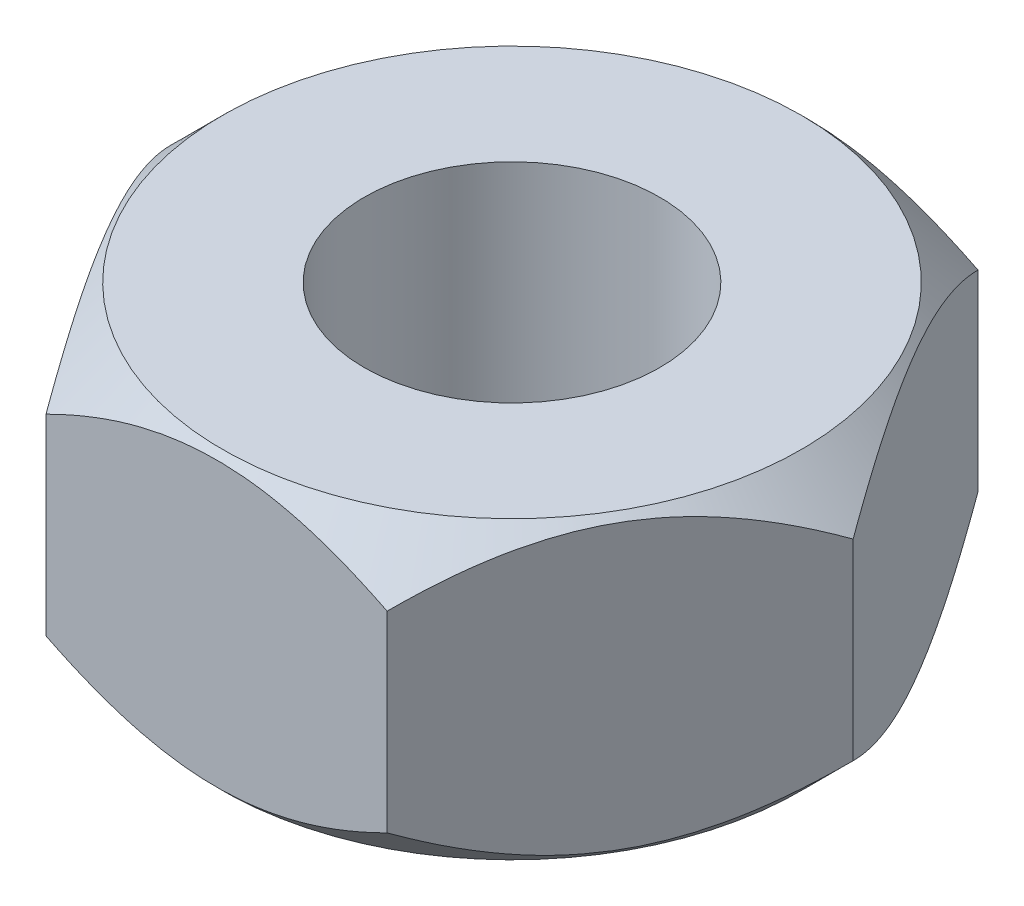
ISO-10303-21;
HEADER;
FILE_DESCRIPTION(('STEP AP214'),'2;1');
FILE_NAME('part.step','',(''),(''),'','','');
FILE_SCHEMA(('AUTOMOTIVE_DESIGN { 1 0 10303 214 1 1 1 1 }'));
ENDSEC;
DATA;
#1=APPLICATION_CONTEXT('core data for automotive mechanical design processes');
#2=APPLICATION_PROTOCOL_DEFINITION('international standard','automotive_design',2000,#1);
#3=PRODUCT_CONTEXT('',#1,'mechanical');
#4=PRODUCT('Part','Part','',(#3));
#5=PRODUCT_RELATED_PRODUCT_CATEGORY('part','',(#4));
#6=PRODUCT_DEFINITION_FORMATION('','',#4);
#7=PRODUCT_DEFINITION_CONTEXT('part definition',#1,'design');
#8=PRODUCT_DEFINITION('design','',#6,#7);
#9=PRODUCT_DEFINITION_SHAPE('','',#8);
#10=(LENGTH_UNIT() NAMED_UNIT(*) SI_UNIT(.MILLI.,.METRE.));
#11=(NAMED_UNIT(*) PLANE_ANGLE_UNIT() SI_UNIT($,.RADIAN.));
#12=(NAMED_UNIT(*) SI_UNIT($,.STERADIAN.) SOLID_ANGLE_UNIT());
#13=UNCERTAINTY_MEASURE_WITH_UNIT(LENGTH_MEASURE(1.E-05),#10,'distance_accuracy_value','');
#14=(GEOMETRIC_REPRESENTATION_CONTEXT(3) GLOBAL_UNCERTAINTY_ASSIGNED_CONTEXT((#13)) GLOBAL_UNIT_ASSIGNED_CONTEXT((#10,
#11,#12)) REPRESENTATION_CONTEXT('',''));
#15=CARTESIAN_POINT('',(0.,0.,0.));
#16=DIRECTION('',(0.,0.,1.));
#17=DIRECTION('',(1.,0.,0.));
#18=AXIS2_PLACEMENT_3D('',#15,#16,#17);
#19=CARTESIAN_POINT('',(4.61880215351701,2.,0.));
#20=DIRECTION('',(-0.866025403784439,0.,0.5));
#21=DIRECTION('',(0.5,0.,0.866025403784439));
#22=AXIS2_PLACEMENT_3D('',#19,#20,#21);
#23=PLANE('',#22);
#24=CARTESIAN_POINT('',(2.30928560670466,-1.29988452561614,-4.0002));
#25=CARTESIAN_POINT('',(2.34899632674695,-1.33959114404244,-3.93141901528162));
#26=CARTESIAN_POINT('',(2.3890109267086,-1.37807958288684,-3.8621116951035));
#27=CARTESIAN_POINT('',(2.46971048312824,-1.45224877626449,-3.72233596323641));
#28=CARTESIAN_POINT('',(2.51039579126537,-1.48792799726835,-3.6518669424213));
#29=CARTESIAN_POINT('',(2.63392971018403,-1.590499132349,-3.4378999183961));
#30=CARTESIAN_POINT('',(2.71782823500144,-1.65248688898743,-3.29258341073226));
#31=CARTESIAN_POINT('',(2.88698352725106,-1.75864413099059,-2.99959785018675));
#32=CARTESIAN_POINT('',(2.97219756726618,-1.80308094454656,-2.85200280336236));
#33=CARTESIAN_POINT('',(3.14450730387843,-1.87155101787055,-2.55355358491114));
#34=CARTESIAN_POINT('',(3.23159772331381,-1.89563536213869,-2.40270855359657));
#35=CARTESIAN_POINT('',(3.38169462438279,-1.91736511913947,-2.14273309488645));
#36=CARTESIAN_POINT('',(3.44450772236845,-1.92058108535914,-2.03393761779448));
#37=CARTESIAN_POINT('',(3.57003196860172,-1.915159941775,-1.81652324573669));
#38=CARTESIAN_POINT('',(3.63274307339632,-1.90651867682817,-1.70790442603366));
#39=CARTESIAN_POINT('',(3.7575710821747,-1.87787596150357,-1.49169597262186));
#40=CARTESIAN_POINT('',(3.81968724243514,-1.85786180544874,-1.38410762707968));
#41=CARTESIAN_POINT('',(3.94285275199686,-1.80756584263535,-1.17077870677867));
#42=CARTESIAN_POINT('',(4.00390218271576,-1.77728482312164,-1.06503799100038));
#43=CARTESIAN_POINT('',(4.11227961083266,-1.71498474730578,-0.877322779108259));
#44=CARTESIAN_POINT('',(4.15984755582568,-1.6846037201399,-0.794932681568707));
#45=CARTESIAN_POINT('',(4.25412951504788,-1.61894553543966,-0.631631537958719));
#46=CARTESIAN_POINT('',(4.30084350325071,-1.58366822896022,-0.55072053696725));
#47=CARTESIAN_POINT('',(4.39327037218423,-1.50900831297908,-0.390632503989876));
#48=CARTESIAN_POINT('',(4.43898588170052,-1.4696386129964,-0.311450918813769));
#49=CARTESIAN_POINT('',(4.52957030284816,-1.3873108918567,-0.154554099011848));
#50=CARTESIAN_POINT('',(4.57443971345263,-1.34435507219804,-0.0768380001392365));
#51=CARTESIAN_POINT('',(4.61891762357084,-1.29988452561614,0.000200000000000016));
#52=B_SPLINE_CURVE_WITH_KNOTS('',3,(#24,#25,#26,#27,#28,#29,#30,#31,#32,#33,#34,#35,#36,#37,#38,
#39,#40,#41,#42,#43,#44,#45,#46,#47,#48,#49,#50,#51),.UNSPECIFIED.,.F.,.F.,(4,2,2,2,2,2,2,2,2,2,
2,2,2,4),(0.,0.266361961703662,0.532868334400109,1.06875865685462,1.5961388459405,
2.12219135055579,2.49866160599656,2.87526382203492,3.25228760372074,3.62928248242855,
3.92874944437159,4.22822551811344,4.52678401907573,4.82516056577922),.UNSPECIFIED.);
#53=CARTESIAN_POINT('',(2.3094010767585,-1.3,-4.));
#54=VERTEX_POINT('',#53);
#55=CARTESIAN_POINT('',(4.61880215351701,-1.29999999999999,0.));
#56=VERTEX_POINT('',#55);
#57=EDGE_CURVE('E57',#54,#56,#52,.T.);
#58=ORIENTED_EDGE('',*,*,#57,.F.);
#59=DIRECTION('',(0.,-1.,0.));
#60=VECTOR('',#59,1.);
#61=CARTESIAN_POINT('',(2.3094010767585,2.,-4.));
#62=LINE('',#61,#60);
#63=CARTESIAN_POINT('',(2.3094010767585,1.3,-4.));
#64=VERTEX_POINT('',#63);
#65=EDGE_CURVE('E50',#64,#54,#62,.T.);
#66=ORIENTED_EDGE('',*,*,#65,.F.);
#67=CARTESIAN_POINT('',(4.61891762357084,1.29988452561614,0.000199999999999897));
#68=CARTESIAN_POINT('',(4.57920690352856,1.33959114404244,-0.0685809847183834));
#69=CARTESIAN_POINT('',(4.53919230356691,1.37807958288685,-0.137888304896501));
#70=CARTESIAN_POINT('',(4.45849274714727,1.45224877626449,-0.277664036763593));
#71=CARTESIAN_POINT('',(4.41780743901013,1.48792799726835,-0.348133057578704));
#72=CARTESIAN_POINT('',(4.29427352009148,1.590499132349,-0.5621000816039));
#73=CARTESIAN_POINT('',(4.21037499527407,1.65248688898744,-0.707416589267742));
#74=CARTESIAN_POINT('',(4.04121970302445,1.75864413099059,-1.00040214981325));
#75=CARTESIAN_POINT('',(3.95600566300933,1.80308094454656,-1.14799719663764));
#76=CARTESIAN_POINT('',(3.78369592639708,1.87155101787055,-1.44644641508886));
#77=CARTESIAN_POINT('',(3.6966055069617,1.89563536213869,-1.59729144640343));
#78=CARTESIAN_POINT('',(3.54650860589271,1.91736511913947,-1.85726690511355));
#79=CARTESIAN_POINT('',(3.48369550790705,1.92058108535914,-1.96606238220552));
#80=CARTESIAN_POINT('',(3.35817126167379,1.915159941775,-2.18347675426332));
#81=CARTESIAN_POINT('',(3.29546015687919,1.90651867682817,-2.29209557396634));
#82=CARTESIAN_POINT('',(3.17063214810081,1.87787596150357,-2.50830402737814));
#83=CARTESIAN_POINT('',(3.10851598784037,1.85786180544874,-2.61589237292032));
#84=CARTESIAN_POINT('',(2.98535047827865,1.80756584263535,-2.82922129322133));
#85=CARTESIAN_POINT('',(2.92430104755975,1.77728482312164,-2.93496200899963));
#86=CARTESIAN_POINT('',(2.81592361944285,1.71498474730578,-3.12267722089174));
#87=CARTESIAN_POINT('',(2.76835567444983,1.6846037201399,-3.2050673184313));
#88=CARTESIAN_POINT('',(2.67407371522763,1.61894553543966,-3.36836846204128));
#89=CARTESIAN_POINT('',(2.6273597270248,1.58366822896022,-3.44927946303275));
#90=CARTESIAN_POINT('',(2.53493285809127,1.50900831297908,-3.60936749601013));
#91=CARTESIAN_POINT('',(2.48921734857499,1.4696386129964,-3.68854908118623));
#92=CARTESIAN_POINT('',(2.39863292742735,1.3873108918567,-3.84544590098815));
#93=CARTESIAN_POINT('',(2.35376351682288,1.34435507219804,-3.92316199986077));
#94=CARTESIAN_POINT('',(2.30928560670466,1.29988452561614,-4.0002));
#95=B_SPLINE_CURVE_WITH_KNOTS('',3,(#67,#68,#69,#70,#71,#72,#73,#74,#75,#76,#77,#78,#79,#80,#81,
#82,#83,#84,#85,#86,#87,#88,#89,#90,#91,#92,#93,#94),.UNSPECIFIED.,.F.,.F.,(4,2,2,2,2,2,2,2,2,2,
2,2,2,4),(0.,0.266361961703663,0.53286833440011,1.06875865685462,1.5961388459405,
2.12219135055579,2.49866160599657,2.87526382203493,3.25228760372075,3.62928248242855,
3.92874944437159,4.22822551811344,4.52678401907573,4.82516056577922),.UNSPECIFIED.);
#96=CARTESIAN_POINT('',(4.618802153517,1.3,0.));
#97=VERTEX_POINT('',#96);
#98=EDGE_CURVE('E129',#97,#64,#95,.T.);
#99=ORIENTED_EDGE('',*,*,#98,.F.);
#100=DIRECTION('',(0.,-1.,0.));
#101=VECTOR('',#100,1.);
#102=CARTESIAN_POINT('',(4.61880215351701,2.,0.));
#103=LINE('',#102,#101);
#104=EDGE_CURVE('E106',#97,#56,#103,.T.);
#105=ORIENTED_EDGE('',*,*,#104,.T.);
#106=EDGE_LOOP('',(#58,#66,#99,#105));
#107=FACE_BOUND('',#106,.T.);
#108=ADVANCED_FACE('F37',(#107),#23,.F.);
#109=CARTESIAN_POINT('',(2.3094010767585,2.,-4.));
#110=DIRECTION('',(0.,0.,1.));
#111=DIRECTION('',(1.,0.,0.));
#112=AXIS2_PLACEMENT_3D('',#109,#110,#111);
#113=PLANE('',#112);
#114=CARTESIAN_POINT('',(-4.78681449206203,0.319273910576415,-4.));
#115=CARTESIAN_POINT('',(-4.67104008349797,0.230453910789263,-4.));
#116=CARTESIAN_POINT('',(-4.55463815773735,0.14243893989603,-4.));
#117=CARTESIAN_POINT('',(-4.32032412189881,-0.0316142531014706,-4.));
#118=CARTESIAN_POINT('',(-4.20241165794464,-0.117651998302652,-4.));
#119=CARTESIAN_POINT('',(-3.96395938475296,-0.287996404184741,-4.));
#120=CARTESIAN_POINT('',(-3.84340631855997,-0.372284568461999,-4.));
#121=CARTESIAN_POINT('',(-3.60028750313952,-0.537896542327518,-4.));
#122=CARTESIAN_POINT('',(-3.47772189384507,-0.619220556759046,-4.));
#123=CARTESIAN_POINT('',(-3.22251521477572,-0.783196089847759,-4.));
#124=CARTESIAN_POINT('',(-3.08972290431469,-0.865613405269982,-4.));
#125=CARTESIAN_POINT('',(-2.82102210371896,-1.02528760127859,-4.));
#126=CARTESIAN_POINT('',(-2.68511309884137,-1.1025436210766,-4.));
#127=CARTESIAN_POINT('',(-2.41014924678837,-1.25024659927306,-4.));
#128=CARTESIAN_POINT('',(-2.27110522605675,-1.3207135545258,-4.));
#129=CARTESIAN_POINT('',(-1.98910688433591,-1.45325973528072,-4.));
#130=CARTESIAN_POINT('',(-1.84615443515192,-1.51534289414065,-4.));
#131=CARTESIAN_POINT('',(-1.56997288174636,-1.6234247765781,-4.));
#132=CARTESIAN_POINT('',(-1.4371280870701,-1.67039551822276,-4.));
#133=CARTESIAN_POINT('',(-1.16808194542722,-1.75370064413461,-4.));
#134=CARTESIAN_POINT('',(-1.03188038285206,-1.79003434323343,-4.));
#135=CARTESIAN_POINT('',(-0.759289650227042,-1.84950416698731,-4.));
#136=CARTESIAN_POINT('',(-0.622953199238508,-1.87287789770349,-4.));
#137=CARTESIAN_POINT('',(-0.348622081388875,-1.90594495582535,-4.));
#138=CARTESIAN_POINT('',(-0.210627754699727,-1.91564104292016,-4.));
#139=CARTESIAN_POINT('',(0.0597506418957742,-1.92054276275038,-4.));
#140=CARTESIAN_POINT('',(0.192123993251868,-1.91634650776296,-4.));
#141=CARTESIAN_POINT('',(0.455822974914871,-1.89506098686225,-4.));
#142=CARTESIAN_POINT('',(0.587148507853832,-1.87797053654468,-4.));
#143=CARTESIAN_POINT('',(0.850025997668753,-1.83156729638161,-4.));
#144=CARTESIAN_POINT('',(0.981539434199071,-1.80203992185321,-4.));
#145=CARTESIAN_POINT('',(1.24167529836036,-1.73239127253676,-4.));
#146=CARTESIAN_POINT('',(1.37029790184251,-1.69227064404595,-4.));
#147=CARTESIAN_POINT('',(1.63238540595055,-1.600390725109,-4.));
#148=CARTESIAN_POINT('',(1.76564732090925,-1.54805886400987,-4.));
#149=CARTESIAN_POINT('',(2.02873916807871,-1.43531657662984,-4.));
#150=CARTESIAN_POINT('',(2.15856751365365,-1.37490249109738,-4.));
#151=CARTESIAN_POINT('',(2.41540815322982,-1.24742898908148,-4.));
#152=CARTESIAN_POINT('',(2.5424101774856,-1.18034904823898,-4.));
#153=CARTESIAN_POINT('',(2.79350244062854,-1.04102088837257,-4.));
#154=CARTESIAN_POINT('',(2.91759312590425,-0.968773468634677,-4.));
#155=CARTESIAN_POINT('',(3.15717410404656,-0.823793598539983,-4.));
#156=CARTESIAN_POINT('',(3.27278634280148,-0.751261600668097,-4.));
#157=CARTESIAN_POINT('',(3.50202467751727,-0.603114941988064,-4.));
#158=CARTESIAN_POINT('',(3.61565062342367,-0.527500049708325,-4.));
#159=CARTESIAN_POINT('',(3.84026160292468,-0.374354310900573,-4.));
#160=CARTESIAN_POINT('',(3.95126052593079,-0.296843762053549,-4.));
#161=CARTESIAN_POINT('',(4.17173632922504,-0.139748402893968,-4.));
#162=CARTESIAN_POINT('',(4.2812136205638,-0.0601641701448002,-4.));
#163=CARTESIAN_POINT('',(4.39005275405241,0.0202687488517557,-4.));
#164=B_SPLINE_CURVE_WITH_KNOTS('',3,(#114,#115,#116,#117,#118,#119,#120,#121,#122,#123,#124,
#125,#126,#127,#128,#129,#130,#131,#132,#133,#134,#135,#136,#137,#138,#139,#140,#141,#142,#143,
#144,#145,#146,#147,#148,#149,#150,#151,#152,#153,#154,#155,#156,#157,#158,#159,#160,#161,#162,
#163),.UNSPECIFIED.,.F.,.F.,(4,2,2,2,2,2,2,2,2,2,2,2,2,2,2,2,2,2,2,2,2,2,2,2,4),(0.,
0.437768738074165,0.875641979842729,1.31689627841479,1.75812002522053,2.22689529732196,
2.69574855645707,3.16317566763693,3.63038271223574,4.05272994992484,4.4751043864646,
4.88945483060887,5.30372166078581,5.70038877327249,6.09709232629864,6.50094064047318,
6.90476432144563,7.33394152305226,7.7633136977288,8.19405149112168,8.62472280311006,
9.03410865775494,9.44352530694691,9.84964952192373,10.2556618072276),.UNSPECIFIED.);
#165=CARTESIAN_POINT('',(-2.30940107675851,-1.3,-4.));
#166=VERTEX_POINT('',#165);
#167=EDGE_CURVE('E92',#166,#54,#164,.T.);
#168=ORIENTED_EDGE('',*,*,#167,.F.);
#169=DIRECTION('',(0.,-1.,0.));
#170=VECTOR('',#169,1.);
#171=CARTESIAN_POINT('',(-2.3094010767585,2.,-4.));
#172=LINE('',#171,#170);
#173=CARTESIAN_POINT('',(-2.30940107675851,1.3,-4.));
#174=VERTEX_POINT('',#173);
#175=EDGE_CURVE('E112',#174,#166,#172,.T.);
#176=ORIENTED_EDGE('',*,*,#175,.F.);
#177=CARTESIAN_POINT('',(-4.78681449206203,-0.319273910576415,-4.));
#178=CARTESIAN_POINT('',(-4.67104008349797,-0.230453910789263,-4.));
#179=CARTESIAN_POINT('',(-4.55463815773735,-0.14243893989603,-4.));
#180=CARTESIAN_POINT('',(-4.32032412189881,0.0316142531014706,-4.));
#181=CARTESIAN_POINT('',(-4.20241165794464,0.117651998302652,-4.));
#182=CARTESIAN_POINT('',(-3.96395938475296,0.287996404184741,-4.));
#183=CARTESIAN_POINT('',(-3.84340631855997,0.372284568461999,-4.));
#184=CARTESIAN_POINT('',(-3.60028750313952,0.537896542327518,-4.));
#185=CARTESIAN_POINT('',(-3.47772189384507,0.619220556759046,-4.));
#186=CARTESIAN_POINT('',(-3.22251521477572,0.783196089847759,-4.));
#187=CARTESIAN_POINT('',(-3.08972290431469,0.865613405269982,-4.));
#188=CARTESIAN_POINT('',(-2.82102210371896,1.02528760127859,-4.));
#189=CARTESIAN_POINT('',(-2.68511309884137,1.1025436210766,-4.));
#190=CARTESIAN_POINT('',(-2.41014924678837,1.25024659927306,-4.));
#191=CARTESIAN_POINT('',(-2.27110522605675,1.3207135545258,-4.));
#192=CARTESIAN_POINT('',(-1.98910688433591,1.45325973528072,-4.));
#193=CARTESIAN_POINT('',(-1.84615443515192,1.51534289414065,-4.));
#194=CARTESIAN_POINT('',(-1.56997288174636,1.6234247765781,-4.));
#195=CARTESIAN_POINT('',(-1.4371280870701,1.67039551822276,-4.));
#196=CARTESIAN_POINT('',(-1.16808194542722,1.75370064413461,-4.));
#197=CARTESIAN_POINT('',(-1.03188038285206,1.79003434323343,-4.));
#198=CARTESIAN_POINT('',(-0.759289650227042,1.84950416698731,-4.));
#199=CARTESIAN_POINT('',(-0.622953199238508,1.87287789770349,-4.));
#200=CARTESIAN_POINT('',(-0.348622081388875,1.90594495582535,-4.));
#201=CARTESIAN_POINT('',(-0.210627754699727,1.91564104292016,-4.));
#202=CARTESIAN_POINT('',(0.0597506418957742,1.92054276275038,-4.));
#203=CARTESIAN_POINT('',(0.192123993251868,1.91634650776296,-4.));
#204=CARTESIAN_POINT('',(0.455822974914871,1.89506098686225,-4.));
#205=CARTESIAN_POINT('',(0.587148507853832,1.87797053654468,-4.));
#206=CARTESIAN_POINT('',(0.850025997668753,1.83156729638161,-4.));
#207=CARTESIAN_POINT('',(0.981539434199071,1.80203992185321,-4.));
#208=CARTESIAN_POINT('',(1.24167529836036,1.73239127253676,-4.));
#209=CARTESIAN_POINT('',(1.37029790184251,1.69227064404595,-4.));
#210=CARTESIAN_POINT('',(1.63238540595055,1.600390725109,-4.));
#211=CARTESIAN_POINT('',(1.76564732090925,1.54805886400987,-4.));
#212=CARTESIAN_POINT('',(2.02873916807871,1.43531657662984,-4.));
#213=CARTESIAN_POINT('',(2.15856751365365,1.37490249109738,-4.));
#214=CARTESIAN_POINT('',(2.41540815322982,1.24742898908148,-4.));
#215=CARTESIAN_POINT('',(2.5424101774856,1.18034904823898,-4.));
#216=CARTESIAN_POINT('',(2.79350244062854,1.04102088837257,-4.));
#217=CARTESIAN_POINT('',(2.91759312590425,0.968773468634677,-4.));
#218=CARTESIAN_POINT('',(3.15717410404656,0.823793598539983,-4.));
#219=CARTESIAN_POINT('',(3.27278634280148,0.751261600668097,-4.));
#220=CARTESIAN_POINT('',(3.50202467751727,0.603114941988064,-4.));
#221=CARTESIAN_POINT('',(3.61565062342367,0.527500049708325,-4.));
#222=CARTESIAN_POINT('',(3.84026160292468,0.374354310900573,-4.));
#223=CARTESIAN_POINT('',(3.95126052593079,0.296843762053549,-4.));
#224=CARTESIAN_POINT('',(4.17173632922504,0.139748402893968,-4.));
#225=CARTESIAN_POINT('',(4.2812136205638,0.0601641701448002,-4.));
#226=CARTESIAN_POINT('',(4.39005275405241,-0.0202687488517557,-4.));
#227=B_SPLINE_CURVE_WITH_KNOTS('',3,(#177,#178,#179,#180,#181,#182,#183,#184,#185,#186,#187,
#188,#189,#190,#191,#192,#193,#194,#195,#196,#197,#198,#199,#200,#201,#202,#203,#204,#205,#206,
#207,#208,#209,#210,#211,#212,#213,#214,#215,#216,#217,#218,#219,#220,#221,#222,#223,#224,#225,
#226),.UNSPECIFIED.,.F.,.F.,(4,2,2,2,2,2,2,2,2,2,2,2,2,2,2,2,2,2,2,2,2,2,2,2,4),(0.,
0.437768738074165,0.875641979842729,1.31689627841479,1.75812002522053,2.22689529732196,
2.69574855645707,3.16317566763693,3.63038271223574,4.05272994992484,4.4751043864646,
4.88945483060887,5.30372166078581,5.70038877327249,6.09709232629864,6.50094064047318,
6.90476432144563,7.33394152305226,7.7633136977288,8.19405149112168,8.62472280311006,
9.03410865775494,9.44352530694691,9.84964952192373,10.2556618072276),.UNSPECIFIED.);
#228=EDGE_CURVE('E111',#64,#174,#227,.F.);
#229=ORIENTED_EDGE('',*,*,#228,.F.);
#230=ORIENTED_EDGE('',*,*,#65,.T.);
#231=EDGE_LOOP('',(#168,#176,#229,#230));
#232=FACE_BOUND('',#231,.T.);
#233=ADVANCED_FACE('F110',(#232),#113,.F.);
#234=CARTESIAN_POINT('',(-2.3094010767585,2.,-4.));
#235=DIRECTION('',(0.866025403784439,0.,0.5));
#236=DIRECTION('',(0.5,0.,-0.866025403784439));
#237=AXIS2_PLACEMENT_3D('',#234,#235,#236);
#238=PLANE('',#237);
#239=CARTESIAN_POINT('',(-4.61891762357084,-1.29988452561614,0.000200000000000149));
#240=CARTESIAN_POINT('',(-4.57920690352856,-1.33959114404244,-0.0685809847183828));
#241=CARTESIAN_POINT('',(-4.53919230356691,-1.37807958288685,-0.1378883048965));
#242=CARTESIAN_POINT('',(-4.45849274714727,-1.45224877626449,-0.277664036763592));
#243=CARTESIAN_POINT('',(-4.41780743901013,-1.48792799726836,-0.348133057578703));
#244=CARTESIAN_POINT('',(-4.29427352009148,-1.59049913234901,-0.562100081603899));
#245=CARTESIAN_POINT('',(-4.21037499527407,-1.65248688898744,-0.707416589267741));
#246=CARTESIAN_POINT('',(-4.04121970302444,-1.7586441309906,-1.00040214981325));
#247=CARTESIAN_POINT('',(-3.95600566300933,-1.80308094454656,-1.14799719663764));
#248=CARTESIAN_POINT('',(-3.78369592639708,-1.87155101787055,-1.44644641508886));
#249=CARTESIAN_POINT('',(-3.6966055069617,-1.89563536213869,-1.59729144640343));
#250=CARTESIAN_POINT('',(-3.54650860589271,-1.91736511913947,-1.85726690511355));
#251=CARTESIAN_POINT('',(-3.48369550790705,-1.92058108535915,-1.96606238220551));
#252=CARTESIAN_POINT('',(-3.35817126167379,-1.915159941775,-2.18347675426331));
#253=CARTESIAN_POINT('',(-3.29546015687919,-1.90651867682817,-2.29209557396634));
#254=CARTESIAN_POINT('',(-3.17063214810081,-1.87787596150357,-2.50830402737814));
#255=CARTESIAN_POINT('',(-3.10851598784037,-1.85786180544874,-2.61589237292031));
#256=CARTESIAN_POINT('',(-2.98535047827865,-1.80756584263535,-2.82922129322132));
#257=CARTESIAN_POINT('',(-2.92430104755975,-1.77728482312164,-2.93496200899962));
#258=CARTESIAN_POINT('',(-2.81592361944285,-1.71498474730578,-3.12267722089174));
#259=CARTESIAN_POINT('',(-2.76835567444983,-1.6846037201399,-3.20506731843129));
#260=CARTESIAN_POINT('',(-2.67407371522763,-1.61894553543967,-3.36836846204128));
#261=CARTESIAN_POINT('',(-2.6273597270248,-1.58366822896022,-3.44927946303275));
#262=CARTESIAN_POINT('',(-2.53493285809127,-1.50900831297908,-3.60936749601012));
#263=CARTESIAN_POINT('',(-2.48921734857499,-1.4696386129964,-3.68854908118623));
#264=CARTESIAN_POINT('',(-2.39863292742735,-1.3873108918567,-3.84544590098815));
#265=CARTESIAN_POINT('',(-2.35376351682288,-1.34435507219804,-3.92316199986076));
#266=CARTESIAN_POINT('',(-2.30928560670466,-1.29988452561614,-4.0002));
#267=B_SPLINE_CURVE_WITH_KNOTS('',3,(#239,#240,#241,#242,#243,#244,#245,#246,#247,#248,#249,
#250,#251,#252,#253,#254,#255,#256,#257,#258,#259,#260,#261,#262,#263,#264,#265,#266),
.UNSPECIFIED.,.F.,.F.,(4,2,2,2,2,2,2,2,2,2,2,2,2,4),(0.,0.266361961703662,0.532868334400109,
1.06875865685461,1.5961388459405,2.12219135055579,2.49866160599656,2.87526382203492,
3.25228760372074,3.62928248242855,3.92874944437159,4.22822551811343,4.52678401907573,
4.82516056577922),.UNSPECIFIED.);
#268=CARTESIAN_POINT('',(-4.618802153517,-1.3,0.));
#269=VERTEX_POINT('',#268);
#270=EDGE_CURVE('E95',#269,#166,#267,.T.);
#271=ORIENTED_EDGE('',*,*,#270,.F.);
#272=DIRECTION('',(0.,-1.,0.));
#273=VECTOR('',#272,1.);
#274=CARTESIAN_POINT('',(-4.618802153517,2.,0.));
#275=LINE('',#274,#273);
#276=CARTESIAN_POINT('',(-4.618802153517,1.3,0.));
#277=VERTEX_POINT('',#276);
#278=EDGE_CURVE('E113',#277,#269,#275,.T.);
#279=ORIENTED_EDGE('',*,*,#278,.F.);
#280=CARTESIAN_POINT('',(-2.30928560670466,1.29988452561614,-4.0002));
#281=CARTESIAN_POINT('',(-2.34899632674695,1.33959114404244,-3.93141901528162));
#282=CARTESIAN_POINT('',(-2.3890109267086,1.37807958288685,-3.8621116951035));
#283=CARTESIAN_POINT('',(-2.46971048312824,1.45224877626449,-3.72233596323641));
#284=CARTESIAN_POINT('',(-2.51039579126537,1.48792799726835,-3.6518669424213));
#285=CARTESIAN_POINT('',(-2.63392971018402,1.590499132349,-3.4378999183961));
#286=CARTESIAN_POINT('',(-2.71782823500144,1.65248688898744,-3.29258341073226));
#287=CARTESIAN_POINT('',(-2.88698352725106,1.7586441309906,-2.99959785018675));
#288=CARTESIAN_POINT('',(-2.97219756726618,1.80308094454656,-2.85200280336236));
#289=CARTESIAN_POINT('',(-3.14450730387843,1.87155101787055,-2.55355358491114));
#290=CARTESIAN_POINT('',(-3.23159772331381,1.89563536213869,-2.40270855359657));
#291=CARTESIAN_POINT('',(-3.38169462438279,1.91736511913947,-2.14273309488645));
#292=CARTESIAN_POINT('',(-3.44450772236845,1.92058108535915,-2.03393761779448));
#293=CARTESIAN_POINT('',(-3.57003196860172,1.915159941775,-1.81652324573668));
#294=CARTESIAN_POINT('',(-3.63274307339632,1.90651867682817,-1.70790442603366));
#295=CARTESIAN_POINT('',(-3.75757108217469,1.87787596150357,-1.49169597262186));
#296=CARTESIAN_POINT('',(-3.81968724243514,1.85786180544874,-1.38410762707968));
#297=CARTESIAN_POINT('',(-3.94285275199686,1.80756584263535,-1.17077870677867));
#298=CARTESIAN_POINT('',(-4.00390218271576,1.77728482312164,-1.06503799100037));
#299=CARTESIAN_POINT('',(-4.11227961083266,1.71498474730578,-0.877322779108256));
#300=CARTESIAN_POINT('',(-4.15984755582568,1.6846037201399,-0.794932681568705));
#301=CARTESIAN_POINT('',(-4.25412951504788,1.61894553543967,-0.631631537958718));
#302=CARTESIAN_POINT('',(-4.30084350325071,1.58366822896023,-0.550720536967249));
#303=CARTESIAN_POINT('',(-4.39327037218423,1.50900831297908,-0.390632503989875));
#304=CARTESIAN_POINT('',(-4.43898588170052,1.4696386129964,-0.311450918813768));
#305=CARTESIAN_POINT('',(-4.52957030284815,1.3873108918567,-0.154554099011848));
#306=CARTESIAN_POINT('',(-4.57443971345262,1.34435507219805,-0.0768380001392364));
#307=CARTESIAN_POINT('',(-4.61891762357084,1.29988452561614,0.00020000000000018));
#308=B_SPLINE_CURVE_WITH_KNOTS('',3,(#280,#281,#282,#283,#284,#285,#286,#287,#288,#289,#290,
#291,#292,#293,#294,#295,#296,#297,#298,#299,#300,#301,#302,#303,#304,#305,#306,#307),
.UNSPECIFIED.,.F.,.F.,(4,2,2,2,2,2,2,2,2,2,2,2,2,4),(0.,0.266361961703663,0.532868334400109,
1.06875865685462,1.5961388459405,2.12219135055579,2.49866160599657,2.87526382203492,
3.25228760372074,3.62928248242855,3.92874944437159,4.22822551811344,4.52678401907573,
4.82516056577922),.UNSPECIFIED.);
#309=EDGE_CURVE('E166',#174,#277,#308,.T.);
#310=ORIENTED_EDGE('',*,*,#309,.F.);
#311=ORIENTED_EDGE('',*,*,#175,.T.);
#312=EDGE_LOOP('',(#271,#279,#310,#311));
#313=FACE_BOUND('',#312,.T.);
#314=ADVANCED_FACE('F171',(#313),#238,.F.);
#315=CARTESIAN_POINT('',(-4.618802153517,2.,0.));
#316=DIRECTION('',(0.866025403784438,0.,-0.5));
#317=DIRECTION('',(-0.5,0.,-0.866025403784439));
#318=AXIS2_PLACEMENT_3D('',#315,#316,#317);
#319=PLANE('',#318);
#320=CARTESIAN_POINT('',(-2.30928560670466,-1.29988452561614,4.0002));
#321=CARTESIAN_POINT('',(-2.34899632674695,-1.33959114404244,3.93141901528162));
#322=CARTESIAN_POINT('',(-2.38901092670859,-1.37807958288685,3.8621116951035));
#323=CARTESIAN_POINT('',(-2.46971048312824,-1.45224877626449,3.72233596323641));
#324=CARTESIAN_POINT('',(-2.51039579126537,-1.48792799726836,3.6518669424213));
#325=CARTESIAN_POINT('',(-2.63392971018402,-1.590499132349,3.4378999183961));
#326=CARTESIAN_POINT('',(-2.71782823500144,-1.65248688898744,3.29258341073226));
#327=CARTESIAN_POINT('',(-2.88698352725106,-1.7586441309906,2.99959785018675));
#328=CARTESIAN_POINT('',(-2.97219756726618,-1.80308094454656,2.85200280336236));
#329=CARTESIAN_POINT('',(-3.14450730387842,-1.87155101787055,2.55355358491114));
#330=CARTESIAN_POINT('',(-3.23159772331381,-1.8956353621387,2.40270855359657));
#331=CARTESIAN_POINT('',(-3.38169462438279,-1.91736511913947,2.14273309488645));
#332=CARTESIAN_POINT('',(-3.44450772236845,-1.92058108535915,2.03393761779448));
#333=CARTESIAN_POINT('',(-3.57003196860172,-1.915159941775,1.81652324573668));
#334=CARTESIAN_POINT('',(-3.63274307339632,-1.90651867682817,1.70790442603366));
#335=CARTESIAN_POINT('',(-3.75757108217469,-1.87787596150357,1.49169597262186));
#336=CARTESIAN_POINT('',(-3.81968724243513,-1.85786180544874,1.38410762707968));
#337=CARTESIAN_POINT('',(-3.94285275199685,-1.80756584263535,1.17077870677867));
#338=CARTESIAN_POINT('',(-4.00390218271576,-1.77728482312164,1.06503799100037));
#339=CARTESIAN_POINT('',(-4.11227961083266,-1.71498474730578,0.877322779108257));
#340=CARTESIAN_POINT('',(-4.15984755582568,-1.6846037201399,0.794932681568706));
#341=CARTESIAN_POINT('',(-4.25412951504788,-1.61894553543967,0.631631537958719));
#342=CARTESIAN_POINT('',(-4.30084350325071,-1.58366822896023,0.550720536967249));
#343=CARTESIAN_POINT('',(-4.39327037218423,-1.50900831297908,0.390632503989875));
#344=CARTESIAN_POINT('',(-4.43898588170052,-1.4696386129964,0.311450918813768));
#345=CARTESIAN_POINT('',(-4.52957030284815,-1.3873108918567,0.154554099011848));
#346=CARTESIAN_POINT('',(-4.57443971345262,-1.34435507219805,0.0768380001392364));
#347=CARTESIAN_POINT('',(-4.61891762357084,-1.29988452561614,-0.000199999999999972));
#348=B_SPLINE_CURVE_WITH_KNOTS('',3,(#320,#321,#322,#323,#324,#325,#326,#327,#328,#329,#330,
#331,#332,#333,#334,#335,#336,#337,#338,#339,#340,#341,#342,#343,#344,#345,#346,#347),
.UNSPECIFIED.,.F.,.F.,(4,2,2,2,2,2,2,2,2,2,2,2,2,4),(0.,0.266361961703663,0.53286833440011,
1.06875865685462,1.5961388459405,2.1221913505558,2.49866160599657,2.87526382203493,
3.25228760372075,3.62928248242855,3.92874944437159,4.22822551811344,4.52678401907573,
4.82516056577922),.UNSPECIFIED.);
#349=CARTESIAN_POINT('',(-2.30940107675849,-1.3,4.));
#350=VERTEX_POINT('',#349);
#351=EDGE_CURVE('E184',#350,#269,#348,.T.);
#352=ORIENTED_EDGE('',*,*,#351,.F.);
#353=DIRECTION('',(0.,-1.,0.));
#354=VECTOR('',#353,1.);
#355=CARTESIAN_POINT('',(-2.3094010767585,2.,4.));
#356=LINE('',#355,#354);
#357=CARTESIAN_POINT('',(-2.30940107675849,1.3,4.));
#358=VERTEX_POINT('',#357);
#359=EDGE_CURVE('E118',#358,#350,#356,.T.);
#360=ORIENTED_EDGE('',*,*,#359,.F.);
#361=CARTESIAN_POINT('',(-4.61891762357084,1.29988452561614,-0.000199999999999863));
#362=CARTESIAN_POINT('',(-4.57920690352856,1.33959114404244,0.0685809847183833));
#363=CARTESIAN_POINT('',(-4.53919230356691,1.37807958288685,0.137888304896501));
#364=CARTESIAN_POINT('',(-4.45849274714727,1.45224877626449,0.277664036763593));
#365=CARTESIAN_POINT('',(-4.41780743901013,1.48792799726836,0.348133057578704));
#366=CARTESIAN_POINT('',(-4.29427352009148,1.59049913234901,0.562100081603901));
#367=CARTESIAN_POINT('',(-4.21037499527407,1.65248688898744,0.707416589267742));
#368=CARTESIAN_POINT('',(-4.04121970302444,1.7586441309906,1.00040214981325));
#369=CARTESIAN_POINT('',(-3.95600566300933,1.80308094454656,1.14799719663764));
#370=CARTESIAN_POINT('',(-3.78369592639708,1.87155101787055,1.44644641508886));
#371=CARTESIAN_POINT('',(-3.6966055069617,1.8956353621387,1.59729144640343));
#372=CARTESIAN_POINT('',(-3.54650860589271,1.91736511913947,1.85726690511355));
#373=CARTESIAN_POINT('',(-3.48369550790705,1.92058108535915,1.96606238220552));
#374=CARTESIAN_POINT('',(-3.35817126167379,1.915159941775,2.18347675426332));
#375=CARTESIAN_POINT('',(-3.29546015687919,1.90651867682817,2.29209557396634));
#376=CARTESIAN_POINT('',(-3.17063214810081,1.87787596150357,2.50830402737814));
#377=CARTESIAN_POINT('',(-3.10851598784037,1.85786180544874,2.61589237292032));
#378=CARTESIAN_POINT('',(-2.98535047827865,1.80756584263535,2.82922129322133));
#379=CARTESIAN_POINT('',(-2.92430104755974,1.77728482312164,2.93496200899962));
#380=CARTESIAN_POINT('',(-2.81592361944284,1.71498474730578,3.12267722089174));
#381=CARTESIAN_POINT('',(-2.76835567444982,1.6846037201399,3.20506731843129));
#382=CARTESIAN_POINT('',(-2.67407371522762,1.61894553543967,3.36836846204128));
#383=CARTESIAN_POINT('',(-2.6273597270248,1.58366822896023,3.44927946303275));
#384=CARTESIAN_POINT('',(-2.53493285809127,1.50900831297908,3.60936749601013));
#385=CARTESIAN_POINT('',(-2.48921734857498,1.4696386129964,3.68854908118623));
#386=CARTESIAN_POINT('',(-2.39863292742735,1.3873108918567,3.84544590098815));
#387=CARTESIAN_POINT('',(-2.35376351682288,1.34435507219805,3.92316199986077));
#388=CARTESIAN_POINT('',(-2.30928560670466,1.29988452561614,4.0002));
#389=B_SPLINE_CURVE_WITH_KNOTS('',3,(#361,#362,#363,#364,#365,#366,#367,#368,#369,#370,#371,
#372,#373,#374,#375,#376,#377,#378,#379,#380,#381,#382,#383,#384,#385,#386,#387,#388),
.UNSPECIFIED.,.F.,.F.,(4,2,2,2,2,2,2,2,2,2,2,2,2,4),(0.,0.266361961703662,0.53286833440011,
1.06875865685462,1.5961388459405,2.12219135055579,2.49866160599656,2.87526382203492,
3.25228760372074,3.62928248242855,3.92874944437159,4.22822551811344,4.52678401907573,
4.82516056577922),.UNSPECIFIED.);
#390=EDGE_CURVE('E161',#277,#358,#389,.T.);
#391=ORIENTED_EDGE('',*,*,#390,.F.);
#392=ORIENTED_EDGE('',*,*,#278,.T.);
#393=EDGE_LOOP('',(#352,#360,#391,#392));
#394=FACE_BOUND('',#393,.T.);
#395=ADVANCED_FACE('F174',(#394),#319,.F.);
#396=CARTESIAN_POINT('',(-2.3094010767585,2.,4.));
#397=DIRECTION('',(0.,0.,-1.));
#398=DIRECTION('',(-1.,0.,0.));
#399=AXIS2_PLACEMENT_3D('',#396,#397,#398);
#400=PLANE('',#399);
#401=CARTESIAN_POINT('',(-4.78681449206705,0.31927391058027,4.));
#402=CARTESIAN_POINT('',(-4.67104008350284,0.230453910792968,4.));
#403=CARTESIAN_POINT('',(-4.55463815774208,0.142438939899586,4.));
#404=CARTESIAN_POINT('',(-4.32032412190325,-0.031614253098212,4.));
#405=CARTESIAN_POINT('',(-4.20241165794893,-0.117651998299542,4.));
#406=CARTESIAN_POINT('',(-3.96395938475696,-0.287996404181927,4.));
#407=CARTESIAN_POINT('',(-3.84340631856381,-0.372284568459335,4.));
#408=CARTESIAN_POINT('',(-3.60028750314306,-0.53789654232515,4.));
#409=CARTESIAN_POINT('',(-3.47772189384845,-0.619220556756825,4.));
#410=CARTESIAN_POINT('',(-3.22251521477878,-0.783196089845843,4.));
#411=CARTESIAN_POINT('',(-3.08972290431756,-0.865613405268225,4.));
#412=CARTESIAN_POINT('',(-2.82102210372147,-1.02528760127714,4.));
#413=CARTESIAN_POINT('',(-2.6851130988437,-1.10254362107531,4.));
#414=CARTESIAN_POINT('',(-2.41014924679032,-1.25024659927206,4.));
#415=CARTESIAN_POINT('',(-2.27110522605851,-1.32071355452494,4.));
#416=CARTESIAN_POINT('',(-1.98910688433727,-1.45325973528012,4.));
#417=CARTESIAN_POINT('',(-1.84615443515308,-1.51534289414017,4.));
#418=CARTESIAN_POINT('',(-1.56997288174744,-1.6234247765777,4.));
#419=CARTESIAN_POINT('',(-1.4371280870713,-1.67039551822235,4.));
#420=CARTESIAN_POINT('',(-1.16808194542868,-1.7537006441342,4.));
#421=CARTESIAN_POINT('',(-1.03188038285365,-1.79003434323302,4.));
#422=CARTESIAN_POINT('',(-0.759289650228892,-1.84950416698696,4.));
#423=CARTESIAN_POINT('',(-0.622953199240485,-1.87287789770317,4.));
#424=CARTESIAN_POINT('',(-0.348622081391101,-1.90594495582515,4.));
#425=CARTESIAN_POINT('',(-0.210627754702077,-1.91564104292003,4.));
#426=CARTESIAN_POINT('',(0.059750641893212,-1.92054276275042,4.));
#427=CARTESIAN_POINT('',(0.192123993249216,-1.91634650776308,4.));
#428=CARTESIAN_POINT('',(0.45582297491205,-1.89506098686256,4.));
#429=CARTESIAN_POINT('',(0.587148507850931,-1.8779705365451,4.));
#430=CARTESIAN_POINT('',(0.850025997665693,-1.83156729638224,4.));
#431=CARTESIAN_POINT('',(0.981539434195934,-1.80203992185396,4.));
#432=CARTESIAN_POINT('',(1.24167529835707,-1.73239127253774,4.));
#433=CARTESIAN_POINT('',(1.37029790183915,-1.69227064404704,4.));
#434=CARTESIAN_POINT('',(1.63238540594681,-1.60039072511041,4.));
#435=CARTESIAN_POINT('',(1.76564732090519,-1.5480588640115,4.));
#436=CARTESIAN_POINT('',(2.02873916807404,-1.43531657663195,4.));
#437=CARTESIAN_POINT('',(2.15856751364868,-1.37490249109973,4.));
#438=CARTESIAN_POINT('',(2.41540815322426,-1.24742898908435,4.));
#439=CARTESIAN_POINT('',(2.54241017747975,-1.18034904824212,4.));
#440=CARTESIAN_POINT('',(2.79350244062212,-1.04102088837624,4.));
#441=CARTESIAN_POINT('',(2.91759312589755,-0.968773468638618,4.));
#442=CARTESIAN_POINT('',(3.15717410403937,-0.823793598544441,4.));
#443=CARTESIAN_POINT('',(3.27278634279406,-0.751261600672799,4.));
#444=CARTESIAN_POINT('',(3.50202467750939,-0.603114941993253,4.));
#445=CARTESIAN_POINT('',(3.61565062341556,-0.527500049713758,4.));
#446=CARTESIAN_POINT('',(3.84026160291613,-0.374354310906493,4.));
#447=CARTESIAN_POINT('',(3.95126052592203,-0.29684376205971,4.));
#448=CARTESIAN_POINT('',(4.17173632921584,-0.139748402900612,4.));
#449=CARTESIAN_POINT('',(4.28121362055438,-0.0601641701516854,4.));
#450=CARTESIAN_POINT('',(4.39005275404277,0.0202687488446302,4.));
#451=B_SPLINE_CURVE_WITH_KNOTS('',3,(#401,#402,#403,#404,#405,#406,#407,#408,#409,#410,#411,
#412,#413,#414,#415,#416,#417,#418,#419,#420,#421,#422,#423,#424,#425,#426,#427,#428,#429,#430,
#431,#432,#433,#434,#435,#436,#437,#438,#439,#440,#441,#442,#443,#444,#445,#446,#447,#448,#449,
#450),.UNSPECIFIED.,.F.,.F.,(4,2,2,2,2,2,2,2,2,2,2,2,2,2,2,2,2,2,2,2,2,2,2,2,4),(0.,
0.437768738074782,0.875641979843961,1.31689627841665,1.75812002522302,2.22689529732516,
2.69574855646097,3.16317566764153,3.63038271224104,4.05272994992977,4.47510438646916,
4.88945483061308,5.30372166078967,5.70038877327607,6.09709232630194,6.50094064047619,
6.90476432144833,7.33394152305383,7.76331369772925,8.194051491121,8.62472280310824,
9.03410865775216,9.44352530694316,9.84964952191902,10.2556618072219),.UNSPECIFIED.);
#452=CARTESIAN_POINT('',(2.30940107675851,-1.3,3.99999999999999));
#453=VERTEX_POINT('',#452);
#454=EDGE_CURVE('E207',#453,#350,#451,.F.);
#455=ORIENTED_EDGE('',*,*,#454,.F.);
#456=DIRECTION('',(0.,-1.,0.));
#457=VECTOR('',#456,1.);
#458=CARTESIAN_POINT('',(2.3094010767585,2.,4.));
#459=LINE('',#458,#457);
#460=CARTESIAN_POINT('',(2.3094010767585,1.29999999999999,4.));
#461=VERTEX_POINT('',#460);
#462=EDGE_CURVE('E121',#461,#453,#459,.T.);
#463=ORIENTED_EDGE('',*,*,#462,.F.);
#464=CARTESIAN_POINT('',(-4.78681449206705,-0.31927391058027,4.));
#465=CARTESIAN_POINT('',(-4.67104008350284,-0.230453910792968,4.));
#466=CARTESIAN_POINT('',(-4.55463815774208,-0.142438939899586,4.));
#467=CARTESIAN_POINT('',(-4.32032412190325,0.031614253098212,4.));
#468=CARTESIAN_POINT('',(-4.20241165794893,0.117651998299542,4.));
#469=CARTESIAN_POINT('',(-3.96395938475696,0.287996404181927,4.));
#470=CARTESIAN_POINT('',(-3.84340631856381,0.372284568459335,4.));
#471=CARTESIAN_POINT('',(-3.60028750314306,0.53789654232515,4.));
#472=CARTESIAN_POINT('',(-3.47772189384845,0.619220556756825,4.));
#473=CARTESIAN_POINT('',(-3.22251521477878,0.783196089845843,4.));
#474=CARTESIAN_POINT('',(-3.08972290431756,0.865613405268225,4.));
#475=CARTESIAN_POINT('',(-2.82102210372147,1.02528760127714,4.));
#476=CARTESIAN_POINT('',(-2.6851130988437,1.10254362107531,4.));
#477=CARTESIAN_POINT('',(-2.41014924679032,1.25024659927206,4.));
#478=CARTESIAN_POINT('',(-2.27110522605851,1.32071355452494,4.));
#479=CARTESIAN_POINT('',(-1.98910688433727,1.45325973528012,4.));
#480=CARTESIAN_POINT('',(-1.84615443515308,1.51534289414017,4.));
#481=CARTESIAN_POINT('',(-1.56997288174744,1.6234247765777,4.));
#482=CARTESIAN_POINT('',(-1.4371280870713,1.67039551822235,4.));
#483=CARTESIAN_POINT('',(-1.16808194542868,1.7537006441342,4.));
#484=CARTESIAN_POINT('',(-1.03188038285365,1.79003434323302,4.));
#485=CARTESIAN_POINT('',(-0.759289650228892,1.84950416698696,4.));
#486=CARTESIAN_POINT('',(-0.622953199240485,1.87287789770317,4.));
#487=CARTESIAN_POINT('',(-0.348622081391101,1.90594495582515,4.));
#488=CARTESIAN_POINT('',(-0.210627754702077,1.91564104292003,4.));
#489=CARTESIAN_POINT('',(0.059750641893212,1.92054276275042,4.));
#490=CARTESIAN_POINT('',(0.192123993249216,1.91634650776308,4.));
#491=CARTESIAN_POINT('',(0.45582297491205,1.89506098686256,4.));
#492=CARTESIAN_POINT('',(0.587148507850931,1.8779705365451,4.));
#493=CARTESIAN_POINT('',(0.850025997665693,1.83156729638224,4.));
#494=CARTESIAN_POINT('',(0.981539434195934,1.80203992185396,4.));
#495=CARTESIAN_POINT('',(1.24167529835707,1.73239127253774,4.));
#496=CARTESIAN_POINT('',(1.37029790183915,1.69227064404704,4.));
#497=CARTESIAN_POINT('',(1.63238540594681,1.60039072511041,4.));
#498=CARTESIAN_POINT('',(1.76564732090519,1.5480588640115,4.));
#499=CARTESIAN_POINT('',(2.02873916807404,1.43531657663195,4.));
#500=CARTESIAN_POINT('',(2.15856751364868,1.37490249109973,4.));
#501=CARTESIAN_POINT('',(2.41540815322426,1.24742898908435,4.));
#502=CARTESIAN_POINT('',(2.54241017747975,1.18034904824212,4.));
#503=CARTESIAN_POINT('',(2.79350244062212,1.04102088837624,4.));
#504=CARTESIAN_POINT('',(2.91759312589755,0.968773468638618,4.));
#505=CARTESIAN_POINT('',(3.15717410403937,0.823793598544441,4.));
#506=CARTESIAN_POINT('',(3.27278634279406,0.751261600672799,4.));
#507=CARTESIAN_POINT('',(3.50202467750939,0.603114941993253,4.));
#508=CARTESIAN_POINT('',(3.61565062341556,0.527500049713758,4.));
#509=CARTESIAN_POINT('',(3.84026160291613,0.374354310906493,4.));
#510=CARTESIAN_POINT('',(3.95126052592203,0.29684376205971,4.));
#511=CARTESIAN_POINT('',(4.17173632921584,0.139748402900612,4.));
#512=CARTESIAN_POINT('',(4.28121362055438,0.0601641701516854,4.));
#513=CARTESIAN_POINT('',(4.39005275404277,-0.0202687488446302,4.));
#514=B_SPLINE_CURVE_WITH_KNOTS('',3,(#464,#465,#466,#467,#468,#469,#470,#471,#472,#473,#474,
#475,#476,#477,#478,#479,#480,#481,#482,#483,#484,#485,#486,#487,#488,#489,#490,#491,#492,#493,
#494,#495,#496,#497,#498,#499,#500,#501,#502,#503,#504,#505,#506,#507,#508,#509,#510,#511,#512,
#513),.UNSPECIFIED.,.F.,.F.,(4,2,2,2,2,2,2,2,2,2,2,2,2,2,2,2,2,2,2,2,2,2,2,2,4),(0.,
0.437768738074782,0.875641979843961,1.31689627841665,1.75812002522302,2.22689529732516,
2.69574855646097,3.16317566764153,3.63038271224104,4.05272994992977,4.47510438646916,
4.88945483061308,5.30372166078967,5.70038877327607,6.09709232630194,6.50094064047619,
6.90476432144833,7.33394152305383,7.76331369772925,8.194051491121,8.62472280310824,
9.03410865775216,9.44352530694316,9.84964952191902,10.2556618072219),.UNSPECIFIED.);
#515=EDGE_CURVE('E64',#358,#461,#514,.T.);
#516=ORIENTED_EDGE('',*,*,#515,.F.);
#517=ORIENTED_EDGE('',*,*,#359,.T.);
#518=EDGE_LOOP('',(#455,#463,#516,#517));
#519=FACE_BOUND('',#518,.T.);
#520=ADVANCED_FACE('F205',(#519),#400,.F.);
#521=CARTESIAN_POINT('',(2.3094010767585,2.,4.));
#522=DIRECTION('',(-0.866025403784439,0.,-0.5));
#523=DIRECTION('',(-0.5,0.,0.866025403784439));
#524=AXIS2_PLACEMENT_3D('',#521,#522,#523);
#525=PLANE('',#524);
#526=CARTESIAN_POINT('',(4.61891762357084,-1.29988452561614,-0.000200000000000115));
#527=CARTESIAN_POINT('',(4.57920690352856,-1.33959114404244,0.068580984718383));
#528=CARTESIAN_POINT('',(4.53919230356691,-1.37807958288685,0.137888304896501));
#529=CARTESIAN_POINT('',(4.45849274714727,-1.45224877626449,0.277664036763593));
#530=CARTESIAN_POINT('',(4.41780743901013,-1.48792799726835,0.348133057578703));
#531=CARTESIAN_POINT('',(4.29427352009148,-1.590499132349,0.5621000816039));
#532=CARTESIAN_POINT('',(4.21037499527407,-1.65248688898743,0.707416589267742));
#533=CARTESIAN_POINT('',(4.04121970302445,-1.75864413099059,1.00040214981325));
#534=CARTESIAN_POINT('',(3.95600566300933,-1.80308094454656,1.14799719663764));
#535=CARTESIAN_POINT('',(3.78369592639708,-1.87155101787055,1.44644641508886));
#536=CARTESIAN_POINT('',(3.6966055069617,-1.89563536213869,1.59729144640343));
#537=CARTESIAN_POINT('',(3.54650860589272,-1.91736511913947,1.85726690511355));
#538=CARTESIAN_POINT('',(3.48369550790706,-1.92058108535914,1.96606238220552));
#539=CARTESIAN_POINT('',(3.35817126167379,-1.915159941775,2.18347675426332));
#540=CARTESIAN_POINT('',(3.29546015687919,-1.90651867682817,2.29209557396634));
#541=CARTESIAN_POINT('',(3.17063214810081,-1.87787596150357,2.50830402737814));
#542=CARTESIAN_POINT('',(3.10851598784037,-1.85786180544874,2.61589237292032));
#543=CARTESIAN_POINT('',(2.98535047827865,-1.80756584263535,2.82922129322133));
#544=CARTESIAN_POINT('',(2.92430104755975,-1.77728482312164,2.93496200899963));
#545=CARTESIAN_POINT('',(2.81592361944285,-1.71498474730578,3.12267722089175));
#546=CARTESIAN_POINT('',(2.76835567444983,-1.6846037201399,3.2050673184313));
#547=CARTESIAN_POINT('',(2.67407371522763,-1.61894553543966,3.36836846204128));
#548=CARTESIAN_POINT('',(2.6273597270248,-1.58366822896022,3.44927946303275));
#549=CARTESIAN_POINT('',(2.53493285809128,-1.50900831297907,3.60936749601013));
#550=CARTESIAN_POINT('',(2.48921734857499,-1.4696386129964,3.68854908118623));
#551=CARTESIAN_POINT('',(2.39863292742736,-1.3873108918567,3.84544590098815));
#552=CARTESIAN_POINT('',(2.35376351682289,-1.34435507219804,3.92316199986077));
#553=CARTESIAN_POINT('',(2.30928560670467,-1.29988452561614,4.0002));
#554=B_SPLINE_CURVE_WITH_KNOTS('',3,(#526,#527,#528,#529,#530,#531,#532,#533,#534,#535,#536,
#537,#538,#539,#540,#541,#542,#543,#544,#545,#546,#547,#548,#549,#550,#551,#552,#553),
.UNSPECIFIED.,.F.,.F.,(4,2,2,2,2,2,2,2,2,2,2,2,2,4),(0.,0.266361961703663,0.532868334400109,
1.06875865685462,1.5961388459405,2.12219135055579,2.49866160599657,2.87526382203493,
3.25228760372075,3.62928248242855,3.92874944437159,4.22822551811344,4.52678401907573,
4.82516056577922),.UNSPECIFIED.);
#555=EDGE_CURVE('E208',#56,#453,#554,.T.);
#556=ORIENTED_EDGE('',*,*,#555,.F.);
#557=ORIENTED_EDGE('',*,*,#104,.F.);
#558=CARTESIAN_POINT('',(2.30928560670467,1.29988452561614,4.0002));
#559=CARTESIAN_POINT('',(2.34899632674695,1.33959114404244,3.93141901528162));
#560=CARTESIAN_POINT('',(2.3890109267086,1.37807958288684,3.8621116951035));
#561=CARTESIAN_POINT('',(2.46971048312824,1.45224877626449,3.72233596323641));
#562=CARTESIAN_POINT('',(2.51039579126538,1.48792799726835,3.6518669424213));
#563=CARTESIAN_POINT('',(2.63392971018403,1.590499132349,3.4378999183961));
#564=CARTESIAN_POINT('',(2.71782823500144,1.65248688898743,3.29258341073226));
#565=CARTESIAN_POINT('',(2.88698352725106,1.75864413099059,2.99959785018675));
#566=CARTESIAN_POINT('',(2.97219756726618,1.80308094454656,2.85200280336236));
#567=CARTESIAN_POINT('',(3.14450730387843,1.87155101787055,2.55355358491114));
#568=CARTESIAN_POINT('',(3.23159772331381,1.89563536213869,2.40270855359657));
#569=CARTESIAN_POINT('',(3.3816946243828,1.91736511913947,2.14273309488645));
#570=CARTESIAN_POINT('',(3.44450772236846,1.92058108535914,2.03393761779448));
#571=CARTESIAN_POINT('',(3.57003196860172,1.915159941775,1.81652324573668));
#572=CARTESIAN_POINT('',(3.63274307339632,1.90651867682817,1.70790442603366));
#573=CARTESIAN_POINT('',(3.7575710821747,1.87787596150357,1.49169597262186));
#574=CARTESIAN_POINT('',(3.81968724243514,1.85786180544874,1.38410762707968));
#575=CARTESIAN_POINT('',(3.94285275199686,1.80756584263535,1.17077870677867));
#576=CARTESIAN_POINT('',(4.00390218271576,1.77728482312164,1.06503799100038));
#577=CARTESIAN_POINT('',(4.11227961083266,1.71498474730578,0.877322779108257));
#578=CARTESIAN_POINT('',(4.15984755582568,1.6846037201399,0.794932681568706));
#579=CARTESIAN_POINT('',(4.25412951504788,1.61894553543966,0.631631537958719));
#580=CARTESIAN_POINT('',(4.30084350325071,1.58366822896022,0.550720536967249));
#581=CARTESIAN_POINT('',(4.39327037218423,1.50900831297908,0.390632503989875));
#582=CARTESIAN_POINT('',(4.43898588170052,1.4696386129964,0.311450918813768));
#583=CARTESIAN_POINT('',(4.52957030284816,1.3873108918567,0.154554099011847));
#584=CARTESIAN_POINT('',(4.57443971345262,1.34435507219804,0.0768380001392359));
#585=CARTESIAN_POINT('',(4.61891762357084,1.29988452561614,-0.000200000000000064));
#586=B_SPLINE_CURVE_WITH_KNOTS('',3,(#558,#559,#560,#561,#562,#563,#564,#565,#566,#567,#568,
#569,#570,#571,#572,#573,#574,#575,#576,#577,#578,#579,#580,#581,#582,#583,#584,#585),
.UNSPECIFIED.,.F.,.F.,(4,2,2,2,2,2,2,2,2,2,2,2,2,4),(0.,0.266361961703663,0.532868334400109,
1.06875865685462,1.5961388459405,2.12219135055579,2.49866160599657,2.87526382203493,
3.25228760372075,3.62928248242855,3.92874944437159,4.22822551811344,4.52678401907573,
4.82516056577922),.UNSPECIFIED.);
#587=EDGE_CURVE('E11',#461,#97,#586,.T.);
#588=ORIENTED_EDGE('',*,*,#587,.F.);
#589=ORIENTED_EDGE('',*,*,#462,.T.);
#590=EDGE_LOOP('',(#556,#557,#588,#589));
#591=FACE_BOUND('',#590,.T.);
#592=ADVANCED_FACE('F220',(#591),#525,.F.);
#593=CARTESIAN_POINT('',(0.,-2.,0.));
#594=DIRECTION('',(0.,1.,0.));
#595=DIRECTION('',(0.,0.,1.));
#596=AXIS2_PLACEMENT_3D('',#593,#594,#595);
#597=PLANE('',#596);
#598=CARTESIAN_POINT('',(0.,-2.,0.));
#599=DIRECTION('',(0.,1.,0.));
#600=DIRECTION('',(0.,0.,1.));
#601=AXIS2_PLACEMENT_3D('',#598,#599,#600);
#602=CIRCLE('',#601,2.);
#603=CARTESIAN_POINT('',(0.,-2.,2.));
#604=VERTEX_POINT('',#603);
#605=EDGE_CURVE('E126',#604,#604,#602,.T.);
#606=ORIENTED_EDGE('',*,*,#605,.T.);
#607=EDGE_LOOP('',(#606));
#608=FACE_BOUND('',#607,.T.);
#609=CARTESIAN_POINT('',(0.,-2.,0.));
#610=DIRECTION('',(0.,-1.,0.));
#611=DIRECTION('',(0.,0.,-1.));
#612=AXIS2_PLACEMENT_3D('',#609,#610,#611);
#613=CIRCLE('',#612,3.918802153517);
#614=CARTESIAN_POINT('',(0.,-2.,-3.918802153517));
#615=VERTEX_POINT('',#614);
#616=EDGE_CURVE('E209',#615,#615,#613,.T.);
#617=ORIENTED_EDGE('',*,*,#616,.T.);
#618=EDGE_LOOP('',(#617));
#619=FACE_BOUND('',#618,.T.);
#620=ADVANCED_FACE('F225',(#608,#619),#597,.F.);
#621=CARTESIAN_POINT('',(0.,2.,0.));
#622=DIRECTION('',(0.,1.,0.));
#623=DIRECTION('',(0.,0.,1.));
#624=AXIS2_PLACEMENT_3D('',#621,#622,#623);
#625=PLANE('',#624);
#626=CARTESIAN_POINT('',(0.,2.,0.));
#627=DIRECTION('',(0.,1.,0.));
#628=DIRECTION('',(0.,0.,1.));
#629=AXIS2_PLACEMENT_3D('',#626,#627,#628);
#630=CIRCLE('',#629,2.);
#631=CARTESIAN_POINT('',(0.,2.,2.));
#632=VERTEX_POINT('',#631);
#633=EDGE_CURVE('E125',#632,#632,#630,.T.);
#634=ORIENTED_EDGE('',*,*,#633,.F.);
#635=EDGE_LOOP('',(#634));
#636=FACE_BOUND('',#635,.T.);
#637=CARTESIAN_POINT('',(0.,2.,0.));
#638=DIRECTION('',(0.,-1.,0.));
#639=DIRECTION('',(0.,0.,-1.));
#640=AXIS2_PLACEMENT_3D('',#637,#638,#639);
#641=CIRCLE('',#640,3.918802153517);
#642=CARTESIAN_POINT('',(0.,2.,-3.918802153517));
#643=VERTEX_POINT('',#642);
#644=EDGE_CURVE('E107',#643,#643,#641,.T.);
#645=ORIENTED_EDGE('',*,*,#644,.F.);
#646=EDGE_LOOP('',(#645));
#647=FACE_BOUND('',#646,.T.);
#648=ADVANCED_FACE('F229',(#636,#647),#625,.T.);
#649=CARTESIAN_POINT('',(0.,2.,0.));
#650=DIRECTION('',(0.,-1.,0.));
#651=DIRECTION('',(0.,0.,-1.));
#652=AXIS2_PLACEMENT_3D('',#649,#650,#651);
#653=CYLINDRICAL_SURFACE('',#652,2.);
#654=ORIENTED_EDGE('',*,*,#633,.T.);
#655=EDGE_LOOP('',(#654));
#656=FACE_BOUND('',#655,.T.);
#657=ORIENTED_EDGE('',*,*,#605,.F.);
#658=EDGE_LOOP('',(#657));
#659=FACE_BOUND('',#658,.T.);
#660=ADVANCED_FACE('F145',(#656,#659),#653,.F.);
#661=CARTESIAN_POINT('',(0.,1.3,0.));
#662=DIRECTION('',(0.,-1.,0.));
#663=DIRECTION('',(0.,0.,-1.));
#664=AXIS2_PLACEMENT_3D('',#661,#662,#663);
#665=CONICAL_SURFACE('',#664,4.618802153517,0.785398163397446);
#666=ORIENTED_EDGE('',*,*,#644,.T.);
#667=EDGE_LOOP('',(#666));
#668=FACE_BOUND('',#667,.T.);
#669=ORIENTED_EDGE('',*,*,#98,.T.);
#670=ORIENTED_EDGE('',*,*,#228,.T.);
#671=ORIENTED_EDGE('',*,*,#309,.T.);
#672=ORIENTED_EDGE('',*,*,#390,.T.);
#673=ORIENTED_EDGE('',*,*,#515,.T.);
#674=ORIENTED_EDGE('',*,*,#587,.T.);
#675=EDGE_LOOP('',(#669,#670,#671,#672,#673,#674));
#676=FACE_BOUND('',#675,.T.);
#677=ADVANCED_FACE('F140',(#668,#676),#665,.T.);
#678=CARTESIAN_POINT('',(0.,-1.3,0.));
#679=DIRECTION('',(0.,1.,0.));
#680=DIRECTION('',(0.,0.,-1.));
#681=AXIS2_PLACEMENT_3D('',#678,#679,#680);
#682=CONICAL_SURFACE('',#681,4.618802153517,0.785398163397446);
#683=ORIENTED_EDGE('',*,*,#616,.F.);
#684=EDGE_LOOP('',(#683));
#685=FACE_BOUND('',#684,.T.);
#686=ORIENTED_EDGE('',*,*,#57,.T.);
#687=ORIENTED_EDGE('',*,*,#555,.T.);
#688=ORIENTED_EDGE('',*,*,#454,.T.);
#689=ORIENTED_EDGE('',*,*,#351,.T.);
#690=ORIENTED_EDGE('',*,*,#270,.T.);
#691=ORIENTED_EDGE('',*,*,#167,.T.);
#692=EDGE_LOOP('',(#686,#687,#688,#689,#690,#691));
#693=FACE_BOUND('',#692,.T.);
#694=ADVANCED_FACE('F93',(#685,#693),#682,.T.);
#695=CLOSED_SHELL('',(#108,#233,#314,#395,#520,#592,#620,#648,#660,#677,#694));
#696=MANIFOLD_SOLID_BREP('B2',#695);
#697=ADVANCED_BREP_SHAPE_REPRESENTATION('',(#18,#696),#14);
#698=SHAPE_DEFINITION_REPRESENTATION(#9,#697);
ENDSEC;
END-ISO-10303-21;
